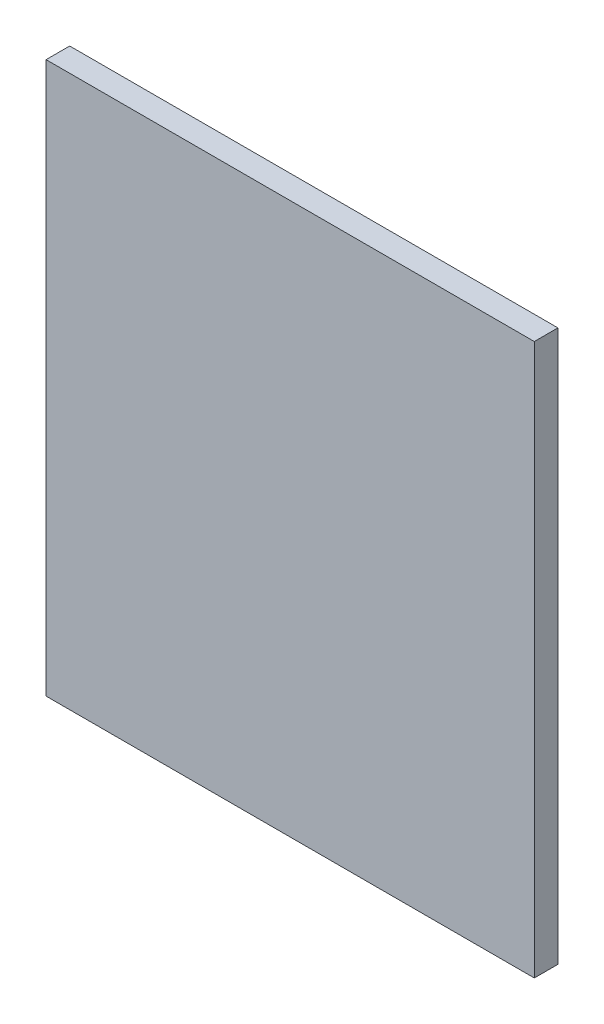
ISO-10303-21;
HEADER;
FILE_DESCRIPTION(('STEP AP214'),'2;1');
FILE_NAME('part.step','',(''),(''),'','','');
FILE_SCHEMA(('AUTOMOTIVE_DESIGN { 1 0 10303 214 1 1 1 1 }'));
ENDSEC;
DATA;
#1=APPLICATION_CONTEXT('core data for automotive mechanical design processes');
#2=APPLICATION_PROTOCOL_DEFINITION('international standard','automotive_design',2000,#1);
#3=PRODUCT_CONTEXT('',#1,'mechanical');
#4=PRODUCT('Part','Part','',(#3));
#5=PRODUCT_RELATED_PRODUCT_CATEGORY('part','',(#4));
#6=PRODUCT_DEFINITION_FORMATION('','',#4);
#7=PRODUCT_DEFINITION_CONTEXT('part definition',#1,'design');
#8=PRODUCT_DEFINITION('design','',#6,#7);
#9=PRODUCT_DEFINITION_SHAPE('','',#8);
#10=(LENGTH_UNIT() NAMED_UNIT(*) SI_UNIT(.MILLI.,.METRE.));
#11=(NAMED_UNIT(*) PLANE_ANGLE_UNIT() SI_UNIT($,.RADIAN.));
#12=(NAMED_UNIT(*) SI_UNIT($,.STERADIAN.) SOLID_ANGLE_UNIT());
#13=UNCERTAINTY_MEASURE_WITH_UNIT(LENGTH_MEASURE(1.E-05),#10,'distance_accuracy_value','');
#14=(GEOMETRIC_REPRESENTATION_CONTEXT(3) GLOBAL_UNCERTAINTY_ASSIGNED_CONTEXT((#13)) GLOBAL_UNIT_ASSIGNED_CONTEXT((#10,
#11,#12)) REPRESENTATION_CONTEXT('',''));
#15=CARTESIAN_POINT('',(0.,0.,0.));
#16=DIRECTION('',(0.,0.,1.));
#17=DIRECTION('',(1.,0.,0.));
#18=AXIS2_PLACEMENT_3D('',#15,#16,#17);
#19=CARTESIAN_POINT('',(155.,175.,15.));
#20=DIRECTION('',(-1.,0.,0.));
#21=DIRECTION('',(0.,-1.,0.));
#22=AXIS2_PLACEMENT_3D('',#19,#20,#21);
#23=PLANE('',#22);
#24=DIRECTION('',(0.,1.,0.));
#25=VECTOR('',#24,1.);
#26=CARTESIAN_POINT('',(155.,175.,0.));
#27=LINE('',#26,#25);
#28=CARTESIAN_POINT('',(155.,-175.,0.));
#29=VERTEX_POINT('',#28);
#30=CARTESIAN_POINT('',(155.,175.,0.));
#31=VERTEX_POINT('',#30);
#32=EDGE_CURVE('E102',#29,#31,#27,.T.);
#33=ORIENTED_EDGE('',*,*,#32,.T.);
#34=DIRECTION('',(0.,0.,-1.));
#35=VECTOR('',#34,1.);
#36=CARTESIAN_POINT('',(155.,175.,15.));
#37=LINE('',#36,#35);
#38=CARTESIAN_POINT('',(155.,175.,15.));
#39=VERTEX_POINT('',#38);
#40=EDGE_CURVE('E11',#39,#31,#37,.T.);
#41=ORIENTED_EDGE('',*,*,#40,.F.);
#42=DIRECTION('',(0.,1.,0.));
#43=VECTOR('',#42,1.);
#44=CARTESIAN_POINT('',(155.,175.,15.));
#45=LINE('',#44,#43);
#46=CARTESIAN_POINT('',(155.,-175.,15.));
#47=VERTEX_POINT('',#46);
#48=EDGE_CURVE('E90',#47,#39,#45,.T.);
#49=ORIENTED_EDGE('',*,*,#48,.F.);
#50=DIRECTION('',(0.,0.,-1.));
#51=VECTOR('',#50,1.);
#52=CARTESIAN_POINT('',(155.,-175.,15.));
#53=LINE('',#52,#51);
#54=EDGE_CURVE('E98',#47,#29,#53,.T.);
#55=ORIENTED_EDGE('',*,*,#54,.T.);
#56=EDGE_LOOP('',(#33,#41,#49,#55));
#57=FACE_BOUND('',#56,.T.);
#58=ADVANCED_FACE('F39',(#57),#23,.F.);
#59=CARTESIAN_POINT('',(-155.,175.,15.));
#60=DIRECTION('',(0.,-1.,0.));
#61=DIRECTION('',(0.,0.,-1.));
#62=AXIS2_PLACEMENT_3D('',#59,#60,#61);
#63=PLANE('',#62);
#64=DIRECTION('',(-1.,0.,0.));
#65=VECTOR('',#64,1.);
#66=CARTESIAN_POINT('',(-155.,175.,0.));
#67=LINE('',#66,#65);
#68=CARTESIAN_POINT('',(-155.,175.,0.));
#69=VERTEX_POINT('',#68);
#70=EDGE_CURVE('E94',#31,#69,#67,.T.);
#71=ORIENTED_EDGE('',*,*,#70,.T.);
#72=DIRECTION('',(0.,0.,-1.));
#73=VECTOR('',#72,1.);
#74=CARTESIAN_POINT('',(-155.,175.,15.));
#75=LINE('',#74,#73);
#76=CARTESIAN_POINT('',(-155.,175.,15.));
#77=VERTEX_POINT('',#76);
#78=EDGE_CURVE('E47',#77,#69,#75,.T.);
#79=ORIENTED_EDGE('',*,*,#78,.F.);
#80=DIRECTION('',(-1.,0.,0.));
#81=VECTOR('',#80,1.);
#82=CARTESIAN_POINT('',(-155.,175.,15.));
#83=LINE('',#82,#81);
#84=EDGE_CURVE('E85',#39,#77,#83,.T.);
#85=ORIENTED_EDGE('',*,*,#84,.F.);
#86=ORIENTED_EDGE('',*,*,#40,.T.);
#87=EDGE_LOOP('',(#71,#79,#85,#86));
#88=FACE_BOUND('',#87,.T.);
#89=ADVANCED_FACE('F93',(#88),#63,.F.);
#90=CARTESIAN_POINT('',(-155.,175.,15.));
#91=DIRECTION('',(1.,0.,0.));
#92=DIRECTION('',(0.,1.,0.));
#93=AXIS2_PLACEMENT_3D('',#90,#91,#92);
#94=PLANE('',#93);
#95=DIRECTION('',(0.,-1.,0.));
#96=VECTOR('',#95,1.);
#97=CARTESIAN_POINT('',(-155.,175.,0.));
#98=LINE('',#97,#96);
#99=CARTESIAN_POINT('',(-155.,-175.,0.));
#100=VERTEX_POINT('',#99);
#101=EDGE_CURVE('E72',#69,#100,#98,.T.);
#102=ORIENTED_EDGE('',*,*,#101,.T.);
#103=DIRECTION('',(0.,0.,-1.));
#104=VECTOR('',#103,1.);
#105=CARTESIAN_POINT('',(-155.,-175.,15.));
#106=LINE('',#105,#104);
#107=CARTESIAN_POINT('',(-155.,-175.,15.));
#108=VERTEX_POINT('',#107);
#109=EDGE_CURVE('E95',#108,#100,#106,.T.);
#110=ORIENTED_EDGE('',*,*,#109,.F.);
#111=DIRECTION('',(0.,-1.,0.));
#112=VECTOR('',#111,1.);
#113=CARTESIAN_POINT('',(-155.,175.,15.));
#114=LINE('',#113,#112);
#115=EDGE_CURVE('E88',#77,#108,#114,.T.);
#116=ORIENTED_EDGE('',*,*,#115,.F.);
#117=ORIENTED_EDGE('',*,*,#78,.T.);
#118=EDGE_LOOP('',(#102,#110,#116,#117));
#119=FACE_BOUND('',#118,.T.);
#120=ADVANCED_FACE('F96',(#119),#94,.F.);
#121=CARTESIAN_POINT('',(-155.,-175.,15.));
#122=DIRECTION('',(0.,1.,0.));
#123=DIRECTION('',(0.,0.,1.));
#124=AXIS2_PLACEMENT_3D('',#121,#122,#123);
#125=PLANE('',#124);
#126=DIRECTION('',(1.,0.,0.));
#127=VECTOR('',#126,1.);
#128=CARTESIAN_POINT('',(-155.,-175.,0.));
#129=LINE('',#128,#127);
#130=EDGE_CURVE('E78',#100,#29,#129,.T.);
#131=ORIENTED_EDGE('',*,*,#130,.T.);
#132=ORIENTED_EDGE('',*,*,#54,.F.);
#133=DIRECTION('',(1.,0.,0.));
#134=VECTOR('',#133,1.);
#135=CARTESIAN_POINT('',(-155.,-175.,15.));
#136=LINE('',#135,#134);
#137=EDGE_CURVE('E55',#108,#47,#136,.T.);
#138=ORIENTED_EDGE('',*,*,#137,.F.);
#139=ORIENTED_EDGE('',*,*,#109,.T.);
#140=EDGE_LOOP('',(#131,#132,#138,#139));
#141=FACE_BOUND('',#140,.T.);
#142=ADVANCED_FACE('F109',(#141),#125,.F.);
#143=CARTESIAN_POINT('',(0.,0.,15.));
#144=DIRECTION('',(0.,0.,1.));
#145=DIRECTION('',(1.,0.,0.));
#146=AXIS2_PLACEMENT_3D('',#143,#144,#145);
#147=PLANE('',#146);
#148=ORIENTED_EDGE('',*,*,#48,.T.);
#149=ORIENTED_EDGE('',*,*,#84,.T.);
#150=ORIENTED_EDGE('',*,*,#115,.T.);
#151=ORIENTED_EDGE('',*,*,#137,.T.);
#152=EDGE_LOOP('',(#148,#149,#150,#151));
#153=FACE_BOUND('',#152,.T.);
#154=ADVANCED_FACE('F86',(#153),#147,.T.);
#155=CARTESIAN_POINT('',(0.,0.,0.));
#156=DIRECTION('',(0.,0.,1.));
#157=DIRECTION('',(1.,0.,0.));
#158=AXIS2_PLACEMENT_3D('',#155,#156,#157);
#159=PLANE('',#158);
#160=ORIENTED_EDGE('',*,*,#32,.F.);
#161=ORIENTED_EDGE('',*,*,#130,.F.);
#162=ORIENTED_EDGE('',*,*,#101,.F.);
#163=ORIENTED_EDGE('',*,*,#70,.F.);
#164=EDGE_LOOP('',(#160,#161,#162,#163));
#165=FACE_BOUND('',#164,.T.);
#166=ADVANCED_FACE('F112',(#165),#159,.F.);
#167=CLOSED_SHELL('',(#58,#89,#120,#142,#154,#166));
#168=MANIFOLD_SOLID_BREP('B2',#167);
#169=ADVANCED_BREP_SHAPE_REPRESENTATION('',(#18,#168),#14);
#170=SHAPE_DEFINITION_REPRESENTATION(#9,#169);
ENDSEC;
END-ISO-10303-21;
